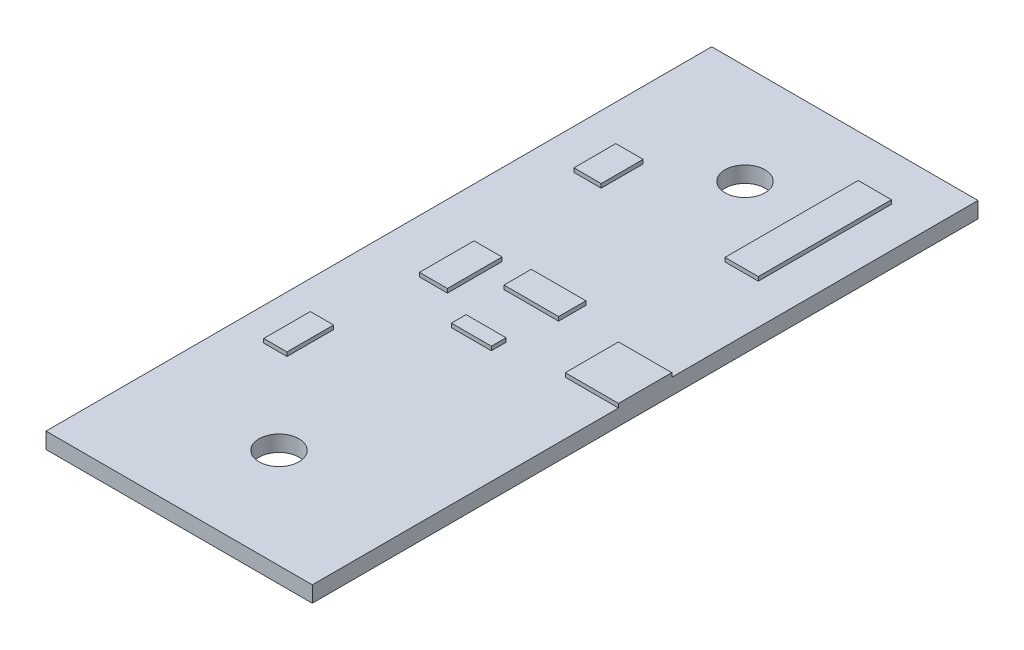
ISO-10303-21;
HEADER;
FILE_DESCRIPTION(('STEP AP214'),'2;1');
FILE_NAME('part.step','',(''),(''),'','','');
FILE_SCHEMA(('AUTOMOTIVE_DESIGN { 1 0 10303 214 1 1 1 1 }'));
ENDSEC;
DATA;
#1=APPLICATION_CONTEXT('core data for automotive mechanical design processes');
#2=APPLICATION_PROTOCOL_DEFINITION('international standard','automotive_design',2000,#1);
#3=PRODUCT_CONTEXT('',#1,'mechanical');
#4=PRODUCT('Part','Part','',(#3));
#5=PRODUCT_RELATED_PRODUCT_CATEGORY('part','',(#4));
#6=PRODUCT_DEFINITION_FORMATION('','',#4);
#7=PRODUCT_DEFINITION_CONTEXT('part definition',#1,'design');
#8=PRODUCT_DEFINITION('design','',#6,#7);
#9=PRODUCT_DEFINITION_SHAPE('','',#8);
#10=(LENGTH_UNIT() NAMED_UNIT(*) SI_UNIT(.MILLI.,.METRE.));
#11=(NAMED_UNIT(*) PLANE_ANGLE_UNIT() SI_UNIT($,.RADIAN.));
#12=(NAMED_UNIT(*) SI_UNIT($,.STERADIAN.) SOLID_ANGLE_UNIT());
#13=UNCERTAINTY_MEASURE_WITH_UNIT(LENGTH_MEASURE(1.E-05),#10,'distance_accuracy_value','');
#14=(GEOMETRIC_REPRESENTATION_CONTEXT(3) GLOBAL_UNCERTAINTY_ASSIGNED_CONTEXT((#13)) GLOBAL_UNIT_ASSIGNED_CONTEXT((#10,
#11,#12)) REPRESENTATION_CONTEXT('',''));
#15=CARTESIAN_POINT('',(0.,0.,0.));
#16=DIRECTION('',(0.,0.,1.));
#17=DIRECTION('',(1.,0.,0.));
#18=AXIS2_PLACEMENT_3D('',#15,#16,#17);
#19=CARTESIAN_POINT('',(10.,1.2,25.));
#20=DIRECTION('',(-1.,0.,0.));
#21=DIRECTION('',(0.,0.,1.));
#22=AXIS2_PLACEMENT_3D('',#19,#20,#21);
#23=PLANE('',#22);
#24=DIRECTION('',(0.,0.,-1.));
#25=VECTOR('',#24,1.);
#26=CARTESIAN_POINT('',(10.,0.,25.));
#27=LINE('',#26,#25);
#28=CARTESIAN_POINT('',(10.,0.,25.));
#29=VERTEX_POINT('',#28);
#30=CARTESIAN_POINT('',(10.,0.,-25.));
#31=VERTEX_POINT('',#30);
#32=EDGE_CURVE('E490',#29,#31,#27,.T.);
#33=ORIENTED_EDGE('',*,*,#32,.T.);
#34=DIRECTION('',(0.,-1.,0.));
#35=VECTOR('',#34,1.);
#36=CARTESIAN_POINT('',(10.,1.2,-25.));
#37=LINE('',#36,#35);
#38=CARTESIAN_POINT('',(10.,1.2,-25.));
#39=VERTEX_POINT('',#38);
#40=EDGE_CURVE('E11',#39,#31,#37,.T.);
#41=ORIENTED_EDGE('',*,*,#40,.F.);
#42=DIRECTION('',(0.,0.,-1.));
#43=VECTOR('',#42,1.);
#44=CARTESIAN_POINT('',(10.,1.2,25.));
#45=LINE('',#44,#43);
#46=CARTESIAN_POINT('',(10.,1.2,-2.));
#47=VERTEX_POINT('',#46);
#48=EDGE_CURVE('E503',#47,#39,#45,.T.);
#49=ORIENTED_EDGE('',*,*,#48,.F.);
#50=DIRECTION('',(0.,-1.,0.));
#51=VECTOR('',#50,1.);
#52=CARTESIAN_POINT('',(10.,1.5,-2.));
#53=LINE('',#52,#51);
#54=CARTESIAN_POINT('',(10.,1.5,-2.));
#55=VERTEX_POINT('',#54);
#56=EDGE_CURVE('E294',#55,#47,#53,.T.);
#57=ORIENTED_EDGE('',*,*,#56,.F.);
#58=DIRECTION('',(0.,0.,1.));
#59=VECTOR('',#58,1.);
#60=CARTESIAN_POINT('',(10.,1.5,2.));
#61=LINE('',#60,#59);
#62=CARTESIAN_POINT('',(10.,1.5,2.));
#63=VERTEX_POINT('',#62);
#64=EDGE_CURVE('E282',#55,#63,#61,.T.);
#65=ORIENTED_EDGE('',*,*,#64,.T.);
#66=DIRECTION('',(0.,-1.,0.));
#67=VECTOR('',#66,1.);
#68=CARTESIAN_POINT('',(10.,1.5,2.));
#69=LINE('',#68,#67);
#70=CARTESIAN_POINT('',(10.,1.2,2.));
#71=VERTEX_POINT('',#70);
#72=EDGE_CURVE('E293',#63,#71,#69,.T.);
#73=ORIENTED_EDGE('',*,*,#72,.T.);
#74=CARTESIAN_POINT('',(10.,1.2,25.));
#75=VERTEX_POINT('',#74);
#76=EDGE_CURVE('E499',#75,#71,#45,.T.);
#77=ORIENTED_EDGE('',*,*,#76,.F.);
#78=DIRECTION('',(0.,-1.,0.));
#79=VECTOR('',#78,1.);
#80=CARTESIAN_POINT('',(10.,1.2,25.));
#81=LINE('',#80,#79);
#82=EDGE_CURVE('E509',#75,#29,#81,.T.);
#83=ORIENTED_EDGE('',*,*,#82,.T.);
#84=EDGE_LOOP('',(#33,#41,#49,#57,#65,#73,#77,#83));
#85=FACE_BOUND('',#84,.T.);
#86=ADVANCED_FACE('F34',(#85),#23,.F.);
#87=CARTESIAN_POINT('',(-9.99999999999999,1.2,-25.));
#88=DIRECTION('',(0.,0.,1.));
#89=DIRECTION('',(1.,0.,0.));
#90=AXIS2_PLACEMENT_3D('',#87,#88,#89);
#91=PLANE('',#90);
#92=DIRECTION('',(-1.,0.,0.));
#93=VECTOR('',#92,1.);
#94=CARTESIAN_POINT('',(-9.99999999999999,0.,-25.));
#95=LINE('',#94,#93);
#96=CARTESIAN_POINT('',(-9.99999999999999,0.,-25.));
#97=VERTEX_POINT('',#96);
#98=EDGE_CURVE('E511',#31,#97,#95,.T.);
#99=ORIENTED_EDGE('',*,*,#98,.T.);
#100=DIRECTION('',(0.,-1.,0.));
#101=VECTOR('',#100,1.);
#102=CARTESIAN_POINT('',(-9.99999999999999,1.2,-25.));
#103=LINE('',#102,#101);
#104=CARTESIAN_POINT('',(-9.99999999999999,1.2,-25.));
#105=VERTEX_POINT('',#104);
#106=EDGE_CURVE('E41',#105,#97,#103,.T.);
#107=ORIENTED_EDGE('',*,*,#106,.F.);
#108=DIRECTION('',(-1.,0.,0.));
#109=VECTOR('',#108,1.);
#110=CARTESIAN_POINT('',(-9.99999999999999,1.2,-25.));
#111=LINE('',#110,#109);
#112=EDGE_CURVE('E502',#39,#105,#111,.T.);
#113=ORIENTED_EDGE('',*,*,#112,.F.);
#114=ORIENTED_EDGE('',*,*,#40,.T.);
#115=EDGE_LOOP('',(#99,#107,#113,#114));
#116=FACE_BOUND('',#115,.T.);
#117=ADVANCED_FACE('F546',(#116),#91,.F.);
#118=CARTESIAN_POINT('',(-9.99999999999999,1.2,25.));
#119=DIRECTION('',(1.,0.,0.));
#120=DIRECTION('',(0.,0.,-1.));
#121=AXIS2_PLACEMENT_3D('',#118,#119,#120);
#122=PLANE('',#121);
#123=DIRECTION('',(0.,0.,1.));
#124=VECTOR('',#123,1.);
#125=CARTESIAN_POINT('',(-9.99999999999999,0.,25.));
#126=LINE('',#125,#124);
#127=CARTESIAN_POINT('',(-9.99999999999999,0.,25.));
#128=VERTEX_POINT('',#127);
#129=EDGE_CURVE('E513',#97,#128,#126,.T.);
#130=ORIENTED_EDGE('',*,*,#129,.T.);
#131=DIRECTION('',(0.,-1.,0.));
#132=VECTOR('',#131,1.);
#133=CARTESIAN_POINT('',(-9.99999999999999,1.2,25.));
#134=LINE('',#133,#132);
#135=CARTESIAN_POINT('',(-9.99999999999999,1.2,25.));
#136=VERTEX_POINT('',#135);
#137=EDGE_CURVE('E519',#136,#128,#134,.T.);
#138=ORIENTED_EDGE('',*,*,#137,.F.);
#139=DIRECTION('',(0.,0.,1.));
#140=VECTOR('',#139,1.);
#141=CARTESIAN_POINT('',(-9.99999999999999,1.2,25.));
#142=LINE('',#141,#140);
#143=EDGE_CURVE('E505',#105,#136,#142,.T.);
#144=ORIENTED_EDGE('',*,*,#143,.F.);
#145=ORIENTED_EDGE('',*,*,#106,.T.);
#146=EDGE_LOOP('',(#130,#138,#144,#145));
#147=FACE_BOUND('',#146,.T.);
#148=ADVANCED_FACE('F526',(#147),#122,.F.);
#149=CARTESIAN_POINT('',(-9.99999999999999,1.2,25.));
#150=DIRECTION('',(0.,0.,-1.));
#151=DIRECTION('',(-1.,0.,0.));
#152=AXIS2_PLACEMENT_3D('',#149,#150,#151);
#153=PLANE('',#152);
#154=DIRECTION('',(1.,0.,0.));
#155=VECTOR('',#154,1.);
#156=CARTESIAN_POINT('',(-9.99999999999999,0.,25.));
#157=LINE('',#156,#155);
#158=EDGE_CURVE('E515',#128,#29,#157,.T.);
#159=ORIENTED_EDGE('',*,*,#158,.T.);
#160=ORIENTED_EDGE('',*,*,#82,.F.);
#161=DIRECTION('',(1.,0.,0.));
#162=VECTOR('',#161,1.);
#163=CARTESIAN_POINT('',(-9.99999999999999,1.2,25.));
#164=LINE('',#163,#162);
#165=EDGE_CURVE('E507',#136,#75,#164,.T.);
#166=ORIENTED_EDGE('',*,*,#165,.F.);
#167=ORIENTED_EDGE('',*,*,#137,.T.);
#168=EDGE_LOOP('',(#159,#160,#166,#167));
#169=FACE_BOUND('',#168,.T.);
#170=ADVANCED_FACE('F538',(#169),#153,.F.);
#171=CARTESIAN_POINT('',(0.,1.2,0.));
#172=DIRECTION('',(0.,-1.,0.));
#173=DIRECTION('',(0.,0.,-1.));
#174=AXIS2_PLACEMENT_3D('',#171,#172,#173);
#175=PLANE('',#174);
#176=DIRECTION('',(-1.,0.,0.));
#177=VECTOR('',#176,1.);
#178=CARTESIAN_POINT('',(0.,1.2,11.1));
#179=LINE('',#178,#177);
#180=CARTESIAN_POINT('',(-5.79999999999999,1.2,11.1));
#181=VERTEX_POINT('',#180);
#182=CARTESIAN_POINT('',(-7.54999999999999,1.2,11.1));
#183=VERTEX_POINT('',#182);
#184=EDGE_CURVE('E277',#181,#183,#179,.T.);
#185=ORIENTED_EDGE('',*,*,#184,.T.);
#186=DIRECTION('',(0.,0.,-1.));
#187=VECTOR('',#186,1.);
#188=CARTESIAN_POINT('',(-7.54999999999999,1.2,0.));
#189=LINE('',#188,#187);
#190=CARTESIAN_POINT('',(-7.54999999999999,1.2,7.59999999999999));
#191=VERTEX_POINT('',#190);
#192=EDGE_CURVE('E280',#183,#191,#189,.T.);
#193=ORIENTED_EDGE('',*,*,#192,.T.);
#194=DIRECTION('',(1.,0.,0.));
#195=VECTOR('',#194,1.);
#196=CARTESIAN_POINT('',(0.,1.2,7.59999999999999));
#197=LINE('',#196,#195);
#198=CARTESIAN_POINT('',(-5.79999999999999,1.2,7.59999999999999));
#199=VERTEX_POINT('',#198);
#200=EDGE_CURVE('E245',#191,#199,#197,.T.);
#201=ORIENTED_EDGE('',*,*,#200,.T.);
#202=DIRECTION('',(0.,0.,1.));
#203=VECTOR('',#202,1.);
#204=CARTESIAN_POINT('',(-5.79999999999999,1.2,0.));
#205=LINE('',#204,#203);
#206=EDGE_CURVE('E274',#199,#181,#205,.T.);
#207=ORIENTED_EDGE('',*,*,#206,.T.);
#208=EDGE_LOOP('',(#185,#193,#201,#207));
#209=FACE_BOUND('',#208,.T.);
#210=DIRECTION('',(-1.,0.,0.));
#211=VECTOR('',#210,1.);
#212=CARTESIAN_POINT('',(0.,1.2,3.04999999999999));
#213=LINE('',#212,#211);
#214=CARTESIAN_POINT('',(1.50000000000001,1.2,3.04999999999999));
#215=VERTEX_POINT('',#214);
#216=CARTESIAN_POINT('',(-1.49999999999999,1.2,3.04999999999999));
#217=VERTEX_POINT('',#216);
#218=EDGE_CURVE('E340',#215,#217,#213,.T.);
#219=ORIENTED_EDGE('',*,*,#218,.T.);
#220=DIRECTION('',(0.,0.,-1.));
#221=VECTOR('',#220,1.);
#222=CARTESIAN_POINT('',(-1.49999999999999,1.2,0.));
#223=LINE('',#222,#221);
#224=CARTESIAN_POINT('',(-1.49999999999999,1.2,1.94999999999999));
#225=VERTEX_POINT('',#224);
#226=EDGE_CURVE('E343',#217,#225,#223,.T.);
#227=ORIENTED_EDGE('',*,*,#226,.T.);
#228=DIRECTION('',(1.,0.,0.));
#229=VECTOR('',#228,1.);
#230=CARTESIAN_POINT('',(0.,1.2,1.94999999999999));
#231=LINE('',#230,#229);
#232=CARTESIAN_POINT('',(1.50000000000001,1.2,1.94999999999999));
#233=VERTEX_POINT('',#232);
#234=EDGE_CURVE('E327',#225,#233,#231,.T.);
#235=ORIENTED_EDGE('',*,*,#234,.T.);
#236=DIRECTION('',(0.,0.,1.));
#237=VECTOR('',#236,1.);
#238=CARTESIAN_POINT('',(1.50000000000001,1.2,0.));
#239=LINE('',#238,#237);
#240=EDGE_CURVE('E337',#233,#215,#239,.T.);
#241=ORIENTED_EDGE('',*,*,#240,.T.);
#242=EDGE_LOOP('',(#219,#227,#235,#241));
#243=FACE_BOUND('',#242,.T.);
#244=DIRECTION('',(-1.,0.,0.));
#245=VECTOR('',#244,1.);
#246=CARTESIAN_POINT('',(0.,1.2,-1.40000000000002));
#247=LINE('',#246,#245);
#248=CARTESIAN_POINT('',(2.1,1.2,-1.40000000000002));
#249=VERTEX_POINT('',#248);
#250=CARTESIAN_POINT('',(-1.99999999999999,1.2,-1.40000000000002));
#251=VERTEX_POINT('',#250);
#252=EDGE_CURVE('E375',#249,#251,#247,.T.);
#253=ORIENTED_EDGE('',*,*,#252,.T.);
#254=DIRECTION('',(0.,0.,-1.));
#255=VECTOR('',#254,1.);
#256=CARTESIAN_POINT('',(-2.,1.2,0.));
#257=LINE('',#256,#255);
#258=CARTESIAN_POINT('',(-1.99999999999999,1.2,-3.45000000000002));
#259=VERTEX_POINT('',#258);
#260=EDGE_CURVE('E378',#251,#259,#257,.T.);
#261=ORIENTED_EDGE('',*,*,#260,.T.);
#262=DIRECTION('',(1.,0.,0.));
#263=VECTOR('',#262,1.);
#264=CARTESIAN_POINT('',(0.,1.2,-3.45000000000002));
#265=LINE('',#264,#263);
#266=CARTESIAN_POINT('',(2.1,1.2,-3.45000000000002));
#267=VERTEX_POINT('',#266);
#268=EDGE_CURVE('E362',#259,#267,#265,.T.);
#269=ORIENTED_EDGE('',*,*,#268,.T.);
#270=DIRECTION('',(0.,0.,1.));
#271=VECTOR('',#270,1.);
#272=CARTESIAN_POINT('',(2.1,1.2,0.));
#273=LINE('',#272,#271);
#274=EDGE_CURVE('E372',#267,#249,#273,.T.);
#275=ORIENTED_EDGE('',*,*,#274,.T.);
#276=EDGE_LOOP('',(#253,#261,#269,#275));
#277=FACE_BOUND('',#276,.T.);
#278=DIRECTION('',(-1.,0.,0.));
#279=VECTOR('',#278,1.);
#280=CARTESIAN_POINT('',(0.,1.2,0.949999999999986));
#281=LINE('',#280,#279);
#282=CARTESIAN_POINT('',(-3.89999999999999,1.2,0.949999999999986));
#283=VERTEX_POINT('',#282);
#284=CARTESIAN_POINT('',(-5.99999999999999,1.2,0.949999999999986));
#285=VERTEX_POINT('',#284);
#286=EDGE_CURVE('E410',#283,#285,#281,.T.);
#287=ORIENTED_EDGE('',*,*,#286,.T.);
#288=DIRECTION('',(0.,0.,-1.));
#289=VECTOR('',#288,1.);
#290=CARTESIAN_POINT('',(-5.99999999999999,1.2,0.));
#291=LINE('',#290,#289);
#292=CARTESIAN_POINT('',(-5.99999999999999,1.2,-3.15000000000001));
#293=VERTEX_POINT('',#292);
#294=EDGE_CURVE('E413',#285,#293,#291,.T.);
#295=ORIENTED_EDGE('',*,*,#294,.T.);
#296=DIRECTION('',(1.,0.,0.));
#297=VECTOR('',#296,1.);
#298=CARTESIAN_POINT('',(0.,1.2,-3.15000000000001));
#299=LINE('',#298,#297);
#300=CARTESIAN_POINT('',(-3.89999999999999,1.2,-3.15000000000001));
#301=VERTEX_POINT('',#300);
#302=EDGE_CURVE('E397',#293,#301,#299,.T.);
#303=ORIENTED_EDGE('',*,*,#302,.T.);
#304=DIRECTION('',(0.,0.,1.));
#305=VECTOR('',#304,1.);
#306=CARTESIAN_POINT('',(-3.89999999999999,1.2,0.));
#307=LINE('',#306,#305);
#308=EDGE_CURVE('E407',#301,#283,#307,.T.);
#309=ORIENTED_EDGE('',*,*,#308,.T.);
#310=EDGE_LOOP('',(#287,#295,#303,#309));
#311=FACE_BOUND('',#310,.T.);
#312=DIRECTION('',(-1.,0.,0.));
#313=VECTOR('',#312,1.);
#314=CARTESIAN_POINT('',(0.,1.2,-11.65));
#315=LINE('',#314,#313);
#316=CARTESIAN_POINT('',(-4.94999999999999,1.2,-11.65));
#317=VERTEX_POINT('',#316);
#318=CARTESIAN_POINT('',(-7.,1.2,-11.65));
#319=VERTEX_POINT('',#318);
#320=EDGE_CURVE('E445',#317,#319,#315,.T.);
#321=ORIENTED_EDGE('',*,*,#320,.T.);
#322=DIRECTION('',(0.,0.,-1.));
#323=VECTOR('',#322,1.);
#324=CARTESIAN_POINT('',(-7.,1.2,0.));
#325=LINE('',#324,#323);
#326=CARTESIAN_POINT('',(-6.99999999999999,1.2,-14.8));
#327=VERTEX_POINT('',#326);
#328=EDGE_CURVE('E448',#319,#327,#325,.T.);
#329=ORIENTED_EDGE('',*,*,#328,.T.);
#330=DIRECTION('',(1.,0.,0.));
#331=VECTOR('',#330,1.);
#332=CARTESIAN_POINT('',(0.,1.2,-14.8));
#333=LINE('',#332,#331);
#334=CARTESIAN_POINT('',(-4.94999999999999,1.2,-14.8));
#335=VERTEX_POINT('',#334);
#336=EDGE_CURVE('E432',#327,#335,#333,.T.);
#337=ORIENTED_EDGE('',*,*,#336,.T.);
#338=DIRECTION('',(0.,0.,1.));
#339=VECTOR('',#338,1.);
#340=CARTESIAN_POINT('',(-4.94999999999999,1.2,0.));
#341=LINE('',#340,#339);
#342=EDGE_CURVE('E442',#335,#317,#341,.T.);
#343=ORIENTED_EDGE('',*,*,#342,.T.);
#344=EDGE_LOOP('',(#321,#329,#337,#343));
#345=FACE_BOUND('',#344,.T.);
#346=DIRECTION('',(-1.,0.,0.));
#347=VECTOR('',#346,1.);
#348=CARTESIAN_POINT('',(0.,1.2,-11.5));
#349=LINE('',#348,#347);
#350=CARTESIAN_POINT('',(7.00000000000001,1.2,-11.5));
#351=VERTEX_POINT('',#350);
#352=CARTESIAN_POINT('',(4.50000000000001,1.2,-11.5));
#353=VERTEX_POINT('',#352);
#354=EDGE_CURVE('E480',#351,#353,#349,.T.);
#355=ORIENTED_EDGE('',*,*,#354,.T.);
#356=DIRECTION('',(0.,0.,-1.));
#357=VECTOR('',#356,1.);
#358=CARTESIAN_POINT('',(4.50000000000001,1.2,0.));
#359=LINE('',#358,#357);
#360=CARTESIAN_POINT('',(4.50000000000001,1.2,-21.5));
#361=VERTEX_POINT('',#360);
#362=EDGE_CURVE('E483',#353,#361,#359,.T.);
#363=ORIENTED_EDGE('',*,*,#362,.T.);
#364=DIRECTION('',(1.,0.,0.));
#365=VECTOR('',#364,1.);
#366=CARTESIAN_POINT('',(0.,1.2,-21.5));
#367=LINE('',#366,#365);
#368=CARTESIAN_POINT('',(7.00000000000001,1.2,-21.5));
#369=VERTEX_POINT('',#368);
#370=EDGE_CURVE('E467',#361,#369,#367,.T.);
#371=ORIENTED_EDGE('',*,*,#370,.T.);
#372=DIRECTION('',(0.,0.,1.));
#373=VECTOR('',#372,1.);
#374=CARTESIAN_POINT('',(7.00000000000001,1.2,0.));
#375=LINE('',#374,#373);
#376=EDGE_CURVE('E477',#369,#351,#375,.T.);
#377=ORIENTED_EDGE('',*,*,#376,.T.);
#378=EDGE_LOOP('',(#355,#363,#371,#377));
#379=FACE_BOUND('',#378,.T.);
#380=CARTESIAN_POINT('',(0.,1.2,17.5));
#381=DIRECTION('',(0.,-1.,0.));
#382=DIRECTION('',(0.,0.,-1.));
#383=AXIS2_PLACEMENT_3D('',#380,#381,#382);
#384=CIRCLE('',#383,1.5);
#385=CARTESIAN_POINT('',(0.,1.2,16.));
#386=VERTEX_POINT('',#385);
#387=EDGE_CURVE('E487',#386,#386,#384,.T.);
#388=ORIENTED_EDGE('',*,*,#387,.T.);
#389=EDGE_LOOP('',(#388));
#390=FACE_BOUND('',#389,.T.);
#391=CARTESIAN_POINT('',(0.,1.2,-17.5));
#392=DIRECTION('',(0.,-1.,0.));
#393=DIRECTION('',(0.,0.,1.));
#394=AXIS2_PLACEMENT_3D('',#391,#392,#393);
#395=CIRCLE('',#394,1.5);
#396=CARTESIAN_POINT('',(0.,1.2,-16.));
#397=VERTEX_POINT('',#396);
#398=EDGE_CURVE('E494',#397,#397,#395,.T.);
#399=ORIENTED_EDGE('',*,*,#398,.T.);
#400=EDGE_LOOP('',(#399));
#401=FACE_BOUND('',#400,.T.);
#402=DIRECTION('',(0.,0.,-1.));
#403=VECTOR('',#402,1.);
#404=CARTESIAN_POINT('',(6.00000000000001,1.2,0.));
#405=LINE('',#404,#403);
#406=CARTESIAN_POINT('',(6.00000000000001,1.2,2.));
#407=VERTEX_POINT('',#406);
#408=CARTESIAN_POINT('',(6.00000000000001,1.2,-2.));
#409=VERTEX_POINT('',#408);
#410=EDGE_CURVE('E305',#407,#409,#405,.T.);
#411=ORIENTED_EDGE('',*,*,#410,.T.);
#412=DIRECTION('',(1.,0.,0.));
#413=VECTOR('',#412,1.);
#414=CARTESIAN_POINT('',(0.,1.2,-2.));
#415=LINE('',#414,#413);
#416=EDGE_CURVE('E308',#409,#47,#415,.T.);
#417=ORIENTED_EDGE('',*,*,#416,.T.);
#418=ORIENTED_EDGE('',*,*,#48,.T.);
#419=ORIENTED_EDGE('',*,*,#112,.T.);
#420=ORIENTED_EDGE('',*,*,#143,.T.);
#421=ORIENTED_EDGE('',*,*,#165,.T.);
#422=ORIENTED_EDGE('',*,*,#76,.T.);
#423=DIRECTION('',(-1.,0.,0.));
#424=VECTOR('',#423,1.);
#425=CARTESIAN_POINT('',(0.,1.2,2.00000000000001));
#426=LINE('',#425,#424);
#427=EDGE_CURVE('E296',#71,#407,#426,.T.);
#428=ORIENTED_EDGE('',*,*,#427,.T.);
#429=EDGE_LOOP('',(#411,#417,#418,#419,#420,#421,#422,#428));
#430=FACE_BOUND('',#429,.T.);
#431=ADVANCED_FACE('F544',(#209,#243,#277,#311,#345,#379,#390,#401,#430),#175,.F.);
#432=CARTESIAN_POINT('',(0.,0.,0.));
#433=DIRECTION('',(0.,-1.,0.));
#434=DIRECTION('',(0.,0.,-1.));
#435=AXIS2_PLACEMENT_3D('',#432,#433,#434);
#436=PLANE('',#435);
#437=ORIENTED_EDGE('',*,*,#98,.F.);
#438=ORIENTED_EDGE('',*,*,#32,.F.);
#439=ORIENTED_EDGE('',*,*,#158,.F.);
#440=ORIENTED_EDGE('',*,*,#129,.F.);
#441=EDGE_LOOP('',(#437,#438,#439,#440));
#442=FACE_BOUND('',#441,.T.);
#443=CARTESIAN_POINT('',(0.,0.,17.5));
#444=DIRECTION('',(0.,-1.,0.));
#445=DIRECTION('',(0.,0.,-1.));
#446=AXIS2_PLACEMENT_3D('',#443,#444,#445);
#447=CIRCLE('',#446,1.5);
#448=CARTESIAN_POINT('',(0.,0.,16.));
#449=VERTEX_POINT('',#448);
#450=EDGE_CURVE('E491',#449,#449,#447,.T.);
#451=ORIENTED_EDGE('',*,*,#450,.F.);
#452=EDGE_LOOP('',(#451));
#453=FACE_BOUND('',#452,.T.);
#454=CARTESIAN_POINT('',(0.,0.,-17.5));
#455=DIRECTION('',(0.,-1.,0.));
#456=DIRECTION('',(0.,0.,1.));
#457=AXIS2_PLACEMENT_3D('',#454,#455,#456);
#458=CIRCLE('',#457,1.5);
#459=CARTESIAN_POINT('',(0.,0.,-16.));
#460=VERTEX_POINT('',#459);
#461=EDGE_CURVE('E486',#460,#460,#458,.T.);
#462=ORIENTED_EDGE('',*,*,#461,.F.);
#463=EDGE_LOOP('',(#462));
#464=FACE_BOUND('',#463,.T.);
#465=ADVANCED_FACE('F533',(#442,#453,#464),#436,.T.);
#466=CARTESIAN_POINT('',(0.,1.2,-17.5));
#467=DIRECTION('',(0.,-1.,0.));
#468=DIRECTION('',(0.,0.,-1.));
#469=AXIS2_PLACEMENT_3D('',#466,#467,#468);
#470=CYLINDRICAL_SURFACE('',#469,1.5);
#471=ORIENTED_EDGE('',*,*,#398,.F.);
#472=EDGE_LOOP('',(#471));
#473=FACE_BOUND('',#472,.T.);
#474=ORIENTED_EDGE('',*,*,#461,.T.);
#475=EDGE_LOOP('',(#474));
#476=FACE_BOUND('',#475,.T.);
#477=ADVANCED_FACE('F580',(#473,#476),#470,.F.);
#478=CARTESIAN_POINT('',(0.,1.2,17.5));
#479=DIRECTION('',(0.,-1.,0.));
#480=DIRECTION('',(0.,0.,-1.));
#481=AXIS2_PLACEMENT_3D('',#478,#479,#480);
#482=CYLINDRICAL_SURFACE('',#481,1.5);
#483=ORIENTED_EDGE('',*,*,#387,.F.);
#484=EDGE_LOOP('',(#483));
#485=FACE_BOUND('',#484,.T.);
#486=ORIENTED_EDGE('',*,*,#450,.T.);
#487=EDGE_LOOP('',(#486));
#488=FACE_BOUND('',#487,.T.);
#489=ADVANCED_FACE('F586',(#485,#488),#482,.F.);
#490=CARTESIAN_POINT('',(4.50000000000001,1.5,-21.5));
#491=DIRECTION('',(-1.,0.,0.));
#492=DIRECTION('',(0.,0.,1.));
#493=AXIS2_PLACEMENT_3D('',#490,#491,#492);
#494=PLANE('',#493);
#495=ORIENTED_EDGE('',*,*,#362,.F.);
#496=DIRECTION('',(0.,-1.,0.));
#497=VECTOR('',#496,1.);
#498=CARTESIAN_POINT('',(4.50000000000001,1.5,-11.5));
#499=LINE('',#498,#497);
#500=CARTESIAN_POINT('',(4.50000000000001,1.5,-11.5));
#501=VERTEX_POINT('',#500);
#502=EDGE_CURVE('E464',#501,#353,#499,.T.);
#503=ORIENTED_EDGE('',*,*,#502,.F.);
#504=DIRECTION('',(0.,0.,-1.));
#505=VECTOR('',#504,1.);
#506=CARTESIAN_POINT('',(4.50000000000001,1.5,-21.5));
#507=LINE('',#506,#505);
#508=CARTESIAN_POINT('',(4.50000000000001,1.5,-21.5));
#509=VERTEX_POINT('',#508);
#510=EDGE_CURVE('E451',#501,#509,#507,.T.);
#511=ORIENTED_EDGE('',*,*,#510,.T.);
#512=DIRECTION('',(0.,-1.,0.));
#513=VECTOR('',#512,1.);
#514=CARTESIAN_POINT('',(4.50000000000001,1.5,-21.5));
#515=LINE('',#514,#513);
#516=EDGE_CURVE('E463',#509,#361,#515,.T.);
#517=ORIENTED_EDGE('',*,*,#516,.T.);
#518=EDGE_LOOP('',(#495,#503,#511,#517));
#519=FACE_BOUND('',#518,.T.);
#520=ADVANCED_FACE('F590',(#519),#494,.T.);
#521=CARTESIAN_POINT('',(4.50000000000001,1.5,-11.5));
#522=DIRECTION('',(0.,0.,1.));
#523=DIRECTION('',(1.,0.,0.));
#524=AXIS2_PLACEMENT_3D('',#521,#522,#523);
#525=PLANE('',#524);
#526=ORIENTED_EDGE('',*,*,#354,.F.);
#527=DIRECTION('',(0.,-1.,0.));
#528=VECTOR('',#527,1.);
#529=CARTESIAN_POINT('',(7.00000000000001,1.5,-11.5));
#530=LINE('',#529,#528);
#531=CARTESIAN_POINT('',(7.00000000000001,1.5,-11.5));
#532=VERTEX_POINT('',#531);
#533=EDGE_CURVE('E468',#532,#351,#530,.T.);
#534=ORIENTED_EDGE('',*,*,#533,.F.);
#535=DIRECTION('',(-1.,0.,0.));
#536=VECTOR('',#535,1.);
#537=CARTESIAN_POINT('',(4.50000000000001,1.5,-11.5));
#538=LINE('',#537,#536);
#539=EDGE_CURVE('E460',#532,#501,#538,.T.);
#540=ORIENTED_EDGE('',*,*,#539,.T.);
#541=ORIENTED_EDGE('',*,*,#502,.T.);
#542=EDGE_LOOP('',(#526,#534,#540,#541));
#543=FACE_BOUND('',#542,.T.);
#544=ADVANCED_FACE('F594',(#543),#525,.T.);
#545=CARTESIAN_POINT('',(7.00000000000001,1.5,-21.5));
#546=DIRECTION('',(1.,0.,0.));
#547=DIRECTION('',(0.,0.,-1.));
#548=AXIS2_PLACEMENT_3D('',#545,#546,#547);
#549=PLANE('',#548);
#550=ORIENTED_EDGE('',*,*,#376,.F.);
#551=DIRECTION('',(0.,-1.,0.));
#552=VECTOR('',#551,1.);
#553=CARTESIAN_POINT('',(7.00000000000001,1.5,-21.5));
#554=LINE('',#553,#552);
#555=CARTESIAN_POINT('',(7.00000000000001,1.5,-21.5));
#556=VERTEX_POINT('',#555);
#557=EDGE_CURVE('E471',#556,#369,#554,.T.);
#558=ORIENTED_EDGE('',*,*,#557,.F.);
#559=DIRECTION('',(0.,0.,1.));
#560=VECTOR('',#559,1.);
#561=CARTESIAN_POINT('',(7.00000000000001,1.5,-21.5));
#562=LINE('',#561,#560);
#563=EDGE_CURVE('E457',#556,#532,#562,.T.);
#564=ORIENTED_EDGE('',*,*,#563,.T.);
#565=ORIENTED_EDGE('',*,*,#533,.T.);
#566=EDGE_LOOP('',(#550,#558,#564,#565));
#567=FACE_BOUND('',#566,.T.);
#568=ADVANCED_FACE('F600',(#567),#549,.T.);
#569=CARTESIAN_POINT('',(4.50000000000001,1.5,-21.5));
#570=DIRECTION('',(0.,0.,-1.));
#571=DIRECTION('',(-1.,0.,0.));
#572=AXIS2_PLACEMENT_3D('',#569,#570,#571);
#573=PLANE('',#572);
#574=ORIENTED_EDGE('',*,*,#370,.F.);
#575=ORIENTED_EDGE('',*,*,#516,.F.);
#576=DIRECTION('',(1.,0.,0.));
#577=VECTOR('',#576,1.);
#578=CARTESIAN_POINT('',(4.50000000000001,1.5,-21.5));
#579=LINE('',#578,#577);
#580=EDGE_CURVE('E454',#509,#556,#579,.T.);
#581=ORIENTED_EDGE('',*,*,#580,.T.);
#582=ORIENTED_EDGE('',*,*,#557,.T.);
#583=EDGE_LOOP('',(#574,#575,#581,#582));
#584=FACE_BOUND('',#583,.T.);
#585=ADVANCED_FACE('F596',(#584),#573,.T.);
#586=CARTESIAN_POINT('',(0.,1.5,0.));
#587=DIRECTION('',(0.,1.,0.));
#588=DIRECTION('',(0.,0.,1.));
#589=AXIS2_PLACEMENT_3D('',#586,#587,#588);
#590=PLANE('',#589);
#591=ORIENTED_EDGE('',*,*,#510,.F.);
#592=ORIENTED_EDGE('',*,*,#539,.F.);
#593=ORIENTED_EDGE('',*,*,#563,.F.);
#594=ORIENTED_EDGE('',*,*,#580,.F.);
#595=EDGE_LOOP('',(#591,#592,#593,#594));
#596=FACE_BOUND('',#595,.T.);
#597=ADVANCED_FACE('F599',(#596),#590,.T.);
#598=CARTESIAN_POINT('',(-6.99999999999999,1.5,-14.8));
#599=DIRECTION('',(-1.,0.,0.));
#600=DIRECTION('',(0.,0.,1.));
#601=AXIS2_PLACEMENT_3D('',#598,#599,#600);
#602=PLANE('',#601);
#603=ORIENTED_EDGE('',*,*,#328,.F.);
#604=DIRECTION('',(0.,-1.,0.));
#605=VECTOR('',#604,1.);
#606=CARTESIAN_POINT('',(-7.,1.5,-11.65));
#607=LINE('',#606,#605);
#608=CARTESIAN_POINT('',(-7.,1.5,-11.65));
#609=VERTEX_POINT('',#608);
#610=EDGE_CURVE('E429',#609,#319,#607,.T.);
#611=ORIENTED_EDGE('',*,*,#610,.F.);
#612=DIRECTION('',(0.,0.,-1.));
#613=VECTOR('',#612,1.);
#614=CARTESIAN_POINT('',(-6.99999999999999,1.5,-14.8));
#615=LINE('',#614,#613);
#616=CARTESIAN_POINT('',(-6.99999999999999,1.5,-14.8));
#617=VERTEX_POINT('',#616);
#618=EDGE_CURVE('E416',#609,#617,#615,.T.);
#619=ORIENTED_EDGE('',*,*,#618,.T.);
#620=DIRECTION('',(0.,-1.,0.));
#621=VECTOR('',#620,1.);
#622=CARTESIAN_POINT('',(-6.99999999999999,1.5,-14.8));
#623=LINE('',#622,#621);
#624=EDGE_CURVE('E428',#617,#327,#623,.T.);
#625=ORIENTED_EDGE('',*,*,#624,.T.);
#626=EDGE_LOOP('',(#603,#611,#619,#625));
#627=FACE_BOUND('',#626,.T.);
#628=ADVANCED_FACE('F610',(#627),#602,.T.);
#629=CARTESIAN_POINT('',(-7.,1.5,-11.65));
#630=DIRECTION('',(0.,0.,1.));
#631=DIRECTION('',(1.,0.,0.));
#632=AXIS2_PLACEMENT_3D('',#629,#630,#631);
#633=PLANE('',#632);
#634=ORIENTED_EDGE('',*,*,#320,.F.);
#635=DIRECTION('',(0.,-1.,0.));
#636=VECTOR('',#635,1.);
#637=CARTESIAN_POINT('',(-4.94999999999999,1.5,-11.65));
#638=LINE('',#637,#636);
#639=CARTESIAN_POINT('',(-4.94999999999999,1.5,-11.65));
#640=VERTEX_POINT('',#639);
#641=EDGE_CURVE('E433',#640,#317,#638,.T.);
#642=ORIENTED_EDGE('',*,*,#641,.F.);
#643=DIRECTION('',(-1.,0.,0.));
#644=VECTOR('',#643,1.);
#645=CARTESIAN_POINT('',(-7.,1.5,-11.65));
#646=LINE('',#645,#644);
#647=EDGE_CURVE('E425',#640,#609,#646,.T.);
#648=ORIENTED_EDGE('',*,*,#647,.T.);
#649=ORIENTED_EDGE('',*,*,#610,.T.);
#650=EDGE_LOOP('',(#634,#642,#648,#649));
#651=FACE_BOUND('',#650,.T.);
#652=ADVANCED_FACE('F614',(#651),#633,.T.);
#653=CARTESIAN_POINT('',(-4.94999999999999,1.5,-14.8));
#654=DIRECTION('',(1.,0.,0.));
#655=DIRECTION('',(0.,0.,-1.));
#656=AXIS2_PLACEMENT_3D('',#653,#654,#655);
#657=PLANE('',#656);
#658=ORIENTED_EDGE('',*,*,#342,.F.);
#659=DIRECTION('',(0.,-1.,0.));
#660=VECTOR('',#659,1.);
#661=CARTESIAN_POINT('',(-4.94999999999999,1.5,-14.8));
#662=LINE('',#661,#660);
#663=CARTESIAN_POINT('',(-4.94999999999999,1.5,-14.8));
#664=VERTEX_POINT('',#663);
#665=EDGE_CURVE('E436',#664,#335,#662,.T.);
#666=ORIENTED_EDGE('',*,*,#665,.F.);
#667=DIRECTION('',(0.,0.,1.));
#668=VECTOR('',#667,1.);
#669=CARTESIAN_POINT('',(-4.94999999999999,1.5,-14.8));
#670=LINE('',#669,#668);
#671=EDGE_CURVE('E422',#664,#640,#670,.T.);
#672=ORIENTED_EDGE('',*,*,#671,.T.);
#673=ORIENTED_EDGE('',*,*,#641,.T.);
#674=EDGE_LOOP('',(#658,#666,#672,#673));
#675=FACE_BOUND('',#674,.T.);
#676=ADVANCED_FACE('F620',(#675),#657,.T.);
#677=CARTESIAN_POINT('',(-6.99999999999999,1.5,-14.8));
#678=DIRECTION('',(0.,0.,-1.));
#679=DIRECTION('',(-1.,0.,0.));
#680=AXIS2_PLACEMENT_3D('',#677,#678,#679);
#681=PLANE('',#680);
#682=ORIENTED_EDGE('',*,*,#336,.F.);
#683=ORIENTED_EDGE('',*,*,#624,.F.);
#684=DIRECTION('',(1.,0.,0.));
#685=VECTOR('',#684,1.);
#686=CARTESIAN_POINT('',(-6.99999999999999,1.5,-14.8));
#687=LINE('',#686,#685);
#688=EDGE_CURVE('E419',#617,#664,#687,.T.);
#689=ORIENTED_EDGE('',*,*,#688,.T.);
#690=ORIENTED_EDGE('',*,*,#665,.T.);
#691=EDGE_LOOP('',(#682,#683,#689,#690));
#692=FACE_BOUND('',#691,.T.);
#693=ADVANCED_FACE('F616',(#692),#681,.T.);
#694=CARTESIAN_POINT('',(0.,1.5,0.));
#695=DIRECTION('',(0.,1.,0.));
#696=DIRECTION('',(0.,0.,1.));
#697=AXIS2_PLACEMENT_3D('',#694,#695,#696);
#698=PLANE('',#697);
#699=ORIENTED_EDGE('',*,*,#618,.F.);
#700=ORIENTED_EDGE('',*,*,#647,.F.);
#701=ORIENTED_EDGE('',*,*,#671,.F.);
#702=ORIENTED_EDGE('',*,*,#688,.F.);
#703=EDGE_LOOP('',(#699,#700,#701,#702));
#704=FACE_BOUND('',#703,.T.);
#705=ADVANCED_FACE('F619',(#704),#698,.T.);
#706=CARTESIAN_POINT('',(-5.99999999999999,1.5,0.949999999999986));
#707=DIRECTION('',(-1.,0.,0.));
#708=DIRECTION('',(0.,0.,1.));
#709=AXIS2_PLACEMENT_3D('',#706,#707,#708);
#710=PLANE('',#709);
#711=ORIENTED_EDGE('',*,*,#294,.F.);
#712=DIRECTION('',(0.,-1.,0.));
#713=VECTOR('',#712,1.);
#714=CARTESIAN_POINT('',(-5.99999999999999,1.5,0.949999999999986));
#715=LINE('',#714,#713);
#716=CARTESIAN_POINT('',(-5.99999999999999,1.5,0.949999999999986));
#717=VERTEX_POINT('',#716);
#718=EDGE_CURVE('E394',#717,#285,#715,.T.);
#719=ORIENTED_EDGE('',*,*,#718,.F.);
#720=DIRECTION('',(0.,0.,-1.));
#721=VECTOR('',#720,1.);
#722=CARTESIAN_POINT('',(-5.99999999999999,1.5,0.949999999999986));
#723=LINE('',#722,#721);
#724=CARTESIAN_POINT('',(-5.99999999999999,1.5,-3.15000000000001));
#725=VERTEX_POINT('',#724);
#726=EDGE_CURVE('E381',#717,#725,#723,.T.);
#727=ORIENTED_EDGE('',*,*,#726,.T.);
#728=DIRECTION('',(0.,-1.,0.));
#729=VECTOR('',#728,1.);
#730=CARTESIAN_POINT('',(-5.99999999999999,1.5,-3.15000000000001));
#731=LINE('',#730,#729);
#732=EDGE_CURVE('E393',#725,#293,#731,.T.);
#733=ORIENTED_EDGE('',*,*,#732,.T.);
#734=EDGE_LOOP('',(#711,#719,#727,#733));
#735=FACE_BOUND('',#734,.T.);
#736=ADVANCED_FACE('F630',(#735),#710,.T.);
#737=CARTESIAN_POINT('',(-5.99999999999999,1.5,0.949999999999986));
#738=DIRECTION('',(0.,0.,1.));
#739=DIRECTION('',(1.,0.,0.));
#740=AXIS2_PLACEMENT_3D('',#737,#738,#739);
#741=PLANE('',#740);
#742=ORIENTED_EDGE('',*,*,#286,.F.);
#743=DIRECTION('',(0.,-1.,0.));
#744=VECTOR('',#743,1.);
#745=CARTESIAN_POINT('',(-3.89999999999999,1.5,0.949999999999986));
#746=LINE('',#745,#744);
#747=CARTESIAN_POINT('',(-3.89999999999999,1.5,0.949999999999986));
#748=VERTEX_POINT('',#747);
#749=EDGE_CURVE('E398',#748,#283,#746,.T.);
#750=ORIENTED_EDGE('',*,*,#749,.F.);
#751=DIRECTION('',(-1.,0.,0.));
#752=VECTOR('',#751,1.);
#753=CARTESIAN_POINT('',(-5.99999999999999,1.5,0.949999999999986));
#754=LINE('',#753,#752);
#755=EDGE_CURVE('E390',#748,#717,#754,.T.);
#756=ORIENTED_EDGE('',*,*,#755,.T.);
#757=ORIENTED_EDGE('',*,*,#718,.T.);
#758=EDGE_LOOP('',(#742,#750,#756,#757));
#759=FACE_BOUND('',#758,.T.);
#760=ADVANCED_FACE('F634',(#759),#741,.T.);
#761=CARTESIAN_POINT('',(-3.89999999999999,1.5,0.949999999999986));
#762=DIRECTION('',(1.,0.,0.));
#763=DIRECTION('',(0.,0.,-1.));
#764=AXIS2_PLACEMENT_3D('',#761,#762,#763);
#765=PLANE('',#764);
#766=ORIENTED_EDGE('',*,*,#308,.F.);
#767=DIRECTION('',(0.,-1.,0.));
#768=VECTOR('',#767,1.);
#769=CARTESIAN_POINT('',(-3.89999999999999,1.5,-3.15000000000001));
#770=LINE('',#769,#768);
#771=CARTESIAN_POINT('',(-3.89999999999999,1.5,-3.15000000000001));
#772=VERTEX_POINT('',#771);
#773=EDGE_CURVE('E401',#772,#301,#770,.T.);
#774=ORIENTED_EDGE('',*,*,#773,.F.);
#775=DIRECTION('',(0.,0.,1.));
#776=VECTOR('',#775,1.);
#777=CARTESIAN_POINT('',(-3.89999999999999,1.5,0.949999999999986));
#778=LINE('',#777,#776);
#779=EDGE_CURVE('E387',#772,#748,#778,.T.);
#780=ORIENTED_EDGE('',*,*,#779,.T.);
#781=ORIENTED_EDGE('',*,*,#749,.T.);
#782=EDGE_LOOP('',(#766,#774,#780,#781));
#783=FACE_BOUND('',#782,.T.);
#784=ADVANCED_FACE('F640',(#783),#765,.T.);
#785=CARTESIAN_POINT('',(-5.99999999999999,1.5,-3.15000000000001));
#786=DIRECTION('',(0.,0.,-1.));
#787=DIRECTION('',(-1.,0.,0.));
#788=AXIS2_PLACEMENT_3D('',#785,#786,#787);
#789=PLANE('',#788);
#790=ORIENTED_EDGE('',*,*,#302,.F.);
#791=ORIENTED_EDGE('',*,*,#732,.F.);
#792=DIRECTION('',(1.,0.,0.));
#793=VECTOR('',#792,1.);
#794=CARTESIAN_POINT('',(-5.99999999999999,1.5,-3.15000000000001));
#795=LINE('',#794,#793);
#796=EDGE_CURVE('E384',#725,#772,#795,.T.);
#797=ORIENTED_EDGE('',*,*,#796,.T.);
#798=ORIENTED_EDGE('',*,*,#773,.T.);
#799=EDGE_LOOP('',(#790,#791,#797,#798));
#800=FACE_BOUND('',#799,.T.);
#801=ADVANCED_FACE('F636',(#800),#789,.T.);
#802=CARTESIAN_POINT('',(0.,1.5,0.));
#803=DIRECTION('',(0.,-1.,0.));
#804=DIRECTION('',(0.,0.,-1.));
#805=AXIS2_PLACEMENT_3D('',#802,#803,#804);
#806=PLANE('',#805);
#807=ORIENTED_EDGE('',*,*,#726,.F.);
#808=ORIENTED_EDGE('',*,*,#755,.F.);
#809=ORIENTED_EDGE('',*,*,#779,.F.);
#810=ORIENTED_EDGE('',*,*,#796,.F.);
#811=EDGE_LOOP('',(#807,#808,#809,#810));
#812=FACE_BOUND('',#811,.T.);
#813=ADVANCED_FACE('F639',(#812),#806,.F.);
#814=CARTESIAN_POINT('',(-1.99999999999999,1.5,-1.40000000000002));
#815=DIRECTION('',(-1.,0.,0.));
#816=DIRECTION('',(0.,0.,1.));
#817=AXIS2_PLACEMENT_3D('',#814,#815,#816);
#818=PLANE('',#817);
#819=ORIENTED_EDGE('',*,*,#260,.F.);
#820=DIRECTION('',(0.,-1.,0.));
#821=VECTOR('',#820,1.);
#822=CARTESIAN_POINT('',(-1.99999999999999,1.5,-1.40000000000002));
#823=LINE('',#822,#821);
#824=CARTESIAN_POINT('',(-1.99999999999999,1.5,-1.40000000000002));
#825=VERTEX_POINT('',#824);
#826=EDGE_CURVE('E359',#825,#251,#823,.T.);
#827=ORIENTED_EDGE('',*,*,#826,.F.);
#828=DIRECTION('',(0.,0.,-1.));
#829=VECTOR('',#828,1.);
#830=CARTESIAN_POINT('',(-1.99999999999999,1.5,-1.40000000000002));
#831=LINE('',#830,#829);
#832=CARTESIAN_POINT('',(-1.99999999999999,1.5,-3.45000000000002));
#833=VERTEX_POINT('',#832);
#834=EDGE_CURVE('E346',#825,#833,#831,.T.);
#835=ORIENTED_EDGE('',*,*,#834,.T.);
#836=DIRECTION('',(0.,-1.,0.));
#837=VECTOR('',#836,1.);
#838=CARTESIAN_POINT('',(-1.99999999999999,1.5,-3.45000000000002));
#839=LINE('',#838,#837);
#840=EDGE_CURVE('E358',#833,#259,#839,.T.);
#841=ORIENTED_EDGE('',*,*,#840,.T.);
#842=EDGE_LOOP('',(#819,#827,#835,#841));
#843=FACE_BOUND('',#842,.T.);
#844=ADVANCED_FACE('F650',(#843),#818,.T.);
#845=CARTESIAN_POINT('',(-1.99999999999999,1.5,-1.40000000000002));
#846=DIRECTION('',(0.,0.,1.));
#847=DIRECTION('',(1.,0.,0.));
#848=AXIS2_PLACEMENT_3D('',#845,#846,#847);
#849=PLANE('',#848);
#850=ORIENTED_EDGE('',*,*,#252,.F.);
#851=DIRECTION('',(0.,-1.,0.));
#852=VECTOR('',#851,1.);
#853=CARTESIAN_POINT('',(2.1,1.5,-1.40000000000002));
#854=LINE('',#853,#852);
#855=CARTESIAN_POINT('',(2.1,1.5,-1.40000000000002));
#856=VERTEX_POINT('',#855);
#857=EDGE_CURVE('E363',#856,#249,#854,.T.);
#858=ORIENTED_EDGE('',*,*,#857,.F.);
#859=DIRECTION('',(-1.,0.,0.));
#860=VECTOR('',#859,1.);
#861=CARTESIAN_POINT('',(-1.99999999999999,1.5,-1.40000000000002));
#862=LINE('',#861,#860);
#863=EDGE_CURVE('E355',#856,#825,#862,.T.);
#864=ORIENTED_EDGE('',*,*,#863,.T.);
#865=ORIENTED_EDGE('',*,*,#826,.T.);
#866=EDGE_LOOP('',(#850,#858,#864,#865));
#867=FACE_BOUND('',#866,.T.);
#868=ADVANCED_FACE('F654',(#867),#849,.T.);
#869=CARTESIAN_POINT('',(2.1,1.5,-1.40000000000002));
#870=DIRECTION('',(1.,0.,0.));
#871=DIRECTION('',(0.,0.,-1.));
#872=AXIS2_PLACEMENT_3D('',#869,#870,#871);
#873=PLANE('',#872);
#874=ORIENTED_EDGE('',*,*,#274,.F.);
#875=DIRECTION('',(0.,-1.,0.));
#876=VECTOR('',#875,1.);
#877=CARTESIAN_POINT('',(2.1,1.5,-3.45000000000002));
#878=LINE('',#877,#876);
#879=CARTESIAN_POINT('',(2.1,1.5,-3.45000000000002));
#880=VERTEX_POINT('',#879);
#881=EDGE_CURVE('E366',#880,#267,#878,.T.);
#882=ORIENTED_EDGE('',*,*,#881,.F.);
#883=DIRECTION('',(0.,0.,1.));
#884=VECTOR('',#883,1.);
#885=CARTESIAN_POINT('',(2.1,1.5,-1.40000000000002));
#886=LINE('',#885,#884);
#887=EDGE_CURVE('E352',#880,#856,#886,.T.);
#888=ORIENTED_EDGE('',*,*,#887,.T.);
#889=ORIENTED_EDGE('',*,*,#857,.T.);
#890=EDGE_LOOP('',(#874,#882,#888,#889));
#891=FACE_BOUND('',#890,.T.);
#892=ADVANCED_FACE('F660',(#891),#873,.T.);
#893=CARTESIAN_POINT('',(-1.99999999999999,1.5,-3.45000000000002));
#894=DIRECTION('',(0.,0.,-1.));
#895=DIRECTION('',(-1.,0.,0.));
#896=AXIS2_PLACEMENT_3D('',#893,#894,#895);
#897=PLANE('',#896);
#898=ORIENTED_EDGE('',*,*,#268,.F.);
#899=ORIENTED_EDGE('',*,*,#840,.F.);
#900=DIRECTION('',(1.,0.,0.));
#901=VECTOR('',#900,1.);
#902=CARTESIAN_POINT('',(-1.99999999999999,1.5,-3.45000000000002));
#903=LINE('',#902,#901);
#904=EDGE_CURVE('E349',#833,#880,#903,.T.);
#905=ORIENTED_EDGE('',*,*,#904,.T.);
#906=ORIENTED_EDGE('',*,*,#881,.T.);
#907=EDGE_LOOP('',(#898,#899,#905,#906));
#908=FACE_BOUND('',#907,.T.);
#909=ADVANCED_FACE('F656',(#908),#897,.T.);
#910=CARTESIAN_POINT('',(0.,1.5,0.));
#911=DIRECTION('',(0.,-1.,0.));
#912=DIRECTION('',(0.,0.,-1.));
#913=AXIS2_PLACEMENT_3D('',#910,#911,#912);
#914=PLANE('',#913);
#915=ORIENTED_EDGE('',*,*,#834,.F.);
#916=ORIENTED_EDGE('',*,*,#863,.F.);
#917=ORIENTED_EDGE('',*,*,#887,.F.);
#918=ORIENTED_EDGE('',*,*,#904,.F.);
#919=EDGE_LOOP('',(#915,#916,#917,#918));
#920=FACE_BOUND('',#919,.T.);
#921=ADVANCED_FACE('F659',(#920),#914,.F.);
#922=CARTESIAN_POINT('',(-1.49999999999999,1.5,3.04999999999999));
#923=DIRECTION('',(-1.,0.,0.));
#924=DIRECTION('',(0.,0.,1.));
#925=AXIS2_PLACEMENT_3D('',#922,#923,#924);
#926=PLANE('',#925);
#927=ORIENTED_EDGE('',*,*,#226,.F.);
#928=DIRECTION('',(0.,-1.,0.));
#929=VECTOR('',#928,1.);
#930=CARTESIAN_POINT('',(-1.49999999999999,1.5,3.04999999999999));
#931=LINE('',#930,#929);
#932=CARTESIAN_POINT('',(-1.49999999999999,1.5,3.04999999999999));
#933=VERTEX_POINT('',#932);
#934=EDGE_CURVE('E324',#933,#217,#931,.T.);
#935=ORIENTED_EDGE('',*,*,#934,.F.);
#936=DIRECTION('',(0.,0.,-1.));
#937=VECTOR('',#936,1.);
#938=CARTESIAN_POINT('',(-1.49999999999999,1.5,3.04999999999999));
#939=LINE('',#938,#937);
#940=CARTESIAN_POINT('',(-1.49999999999999,1.5,1.94999999999999));
#941=VERTEX_POINT('',#940);
#942=EDGE_CURVE('E311',#933,#941,#939,.T.);
#943=ORIENTED_EDGE('',*,*,#942,.T.);
#944=DIRECTION('',(0.,-1.,0.));
#945=VECTOR('',#944,1.);
#946=CARTESIAN_POINT('',(-1.49999999999999,1.5,1.94999999999999));
#947=LINE('',#946,#945);
#948=EDGE_CURVE('E323',#941,#225,#947,.T.);
#949=ORIENTED_EDGE('',*,*,#948,.T.);
#950=EDGE_LOOP('',(#927,#935,#943,#949));
#951=FACE_BOUND('',#950,.T.);
#952=ADVANCED_FACE('F670',(#951),#926,.T.);
#953=CARTESIAN_POINT('',(-1.49999999999999,1.5,3.04999999999999));
#954=DIRECTION('',(0.,0.,1.));
#955=DIRECTION('',(1.,0.,0.));
#956=AXIS2_PLACEMENT_3D('',#953,#954,#955);
#957=PLANE('',#956);
#958=ORIENTED_EDGE('',*,*,#218,.F.);
#959=DIRECTION('',(0.,-1.,0.));
#960=VECTOR('',#959,1.);
#961=CARTESIAN_POINT('',(1.50000000000001,1.5,3.04999999999999));
#962=LINE('',#961,#960);
#963=CARTESIAN_POINT('',(1.50000000000001,1.5,3.04999999999999));
#964=VERTEX_POINT('',#963);
#965=EDGE_CURVE('E328',#964,#215,#962,.T.);
#966=ORIENTED_EDGE('',*,*,#965,.F.);
#967=DIRECTION('',(-1.,0.,0.));
#968=VECTOR('',#967,1.);
#969=CARTESIAN_POINT('',(-1.49999999999999,1.5,3.04999999999999));
#970=LINE('',#969,#968);
#971=EDGE_CURVE('E320',#964,#933,#970,.T.);
#972=ORIENTED_EDGE('',*,*,#971,.T.);
#973=ORIENTED_EDGE('',*,*,#934,.T.);
#974=EDGE_LOOP('',(#958,#966,#972,#973));
#975=FACE_BOUND('',#974,.T.);
#976=ADVANCED_FACE('F674',(#975),#957,.T.);
#977=CARTESIAN_POINT('',(1.50000000000001,1.5,3.04999999999999));
#978=DIRECTION('',(1.,0.,0.));
#979=DIRECTION('',(0.,0.,-1.));
#980=AXIS2_PLACEMENT_3D('',#977,#978,#979);
#981=PLANE('',#980);
#982=ORIENTED_EDGE('',*,*,#240,.F.);
#983=DIRECTION('',(0.,-1.,0.));
#984=VECTOR('',#983,1.);
#985=CARTESIAN_POINT('',(1.50000000000001,1.5,1.94999999999999));
#986=LINE('',#985,#984);
#987=CARTESIAN_POINT('',(1.50000000000001,1.5,1.94999999999999));
#988=VERTEX_POINT('',#987);
#989=EDGE_CURVE('E331',#988,#233,#986,.T.);
#990=ORIENTED_EDGE('',*,*,#989,.F.);
#991=DIRECTION('',(0.,0.,1.));
#992=VECTOR('',#991,1.);
#993=CARTESIAN_POINT('',(1.50000000000001,1.5,3.04999999999999));
#994=LINE('',#993,#992);
#995=EDGE_CURVE('E317',#988,#964,#994,.T.);
#996=ORIENTED_EDGE('',*,*,#995,.T.);
#997=ORIENTED_EDGE('',*,*,#965,.T.);
#998=EDGE_LOOP('',(#982,#990,#996,#997));
#999=FACE_BOUND('',#998,.T.);
#1000=ADVANCED_FACE('F680',(#999),#981,.T.);
#1001=CARTESIAN_POINT('',(-1.49999999999999,1.5,1.94999999999999));
#1002=DIRECTION('',(0.,0.,-1.));
#1003=DIRECTION('',(-1.,0.,0.));
#1004=AXIS2_PLACEMENT_3D('',#1001,#1002,#1003);
#1005=PLANE('',#1004);
#1006=ORIENTED_EDGE('',*,*,#234,.F.);
#1007=ORIENTED_EDGE('',*,*,#948,.F.);
#1008=DIRECTION('',(1.,0.,0.));
#1009=VECTOR('',#1008,1.);
#1010=CARTESIAN_POINT('',(-1.49999999999999,1.5,1.94999999999999));
#1011=LINE('',#1010,#1009);
#1012=EDGE_CURVE('E314',#941,#988,#1011,.T.);
#1013=ORIENTED_EDGE('',*,*,#1012,.T.);
#1014=ORIENTED_EDGE('',*,*,#989,.T.);
#1015=EDGE_LOOP('',(#1006,#1007,#1013,#1014));
#1016=FACE_BOUND('',#1015,.T.);
#1017=ADVANCED_FACE('F676',(#1016),#1005,.T.);
#1018=CARTESIAN_POINT('',(0.,1.5,0.));
#1019=DIRECTION('',(0.,-1.,0.));
#1020=DIRECTION('',(0.,0.,-1.));
#1021=AXIS2_PLACEMENT_3D('',#1018,#1019,#1020);
#1022=PLANE('',#1021);
#1023=ORIENTED_EDGE('',*,*,#942,.F.);
#1024=ORIENTED_EDGE('',*,*,#971,.F.);
#1025=ORIENTED_EDGE('',*,*,#995,.F.);
#1026=ORIENTED_EDGE('',*,*,#1012,.F.);
#1027=EDGE_LOOP('',(#1023,#1024,#1025,#1026));
#1028=FACE_BOUND('',#1027,.T.);
#1029=ADVANCED_FACE('F679',(#1028),#1022,.F.);
#1030=CARTESIAN_POINT('',(10.,1.5,-2.));
#1031=DIRECTION('',(0.,0.,-1.));
#1032=DIRECTION('',(-1.,0.,0.));
#1033=AXIS2_PLACEMENT_3D('',#1030,#1031,#1032);
#1034=PLANE('',#1033);
#1035=ORIENTED_EDGE('',*,*,#416,.F.);
#1036=DIRECTION('',(0.,-1.,0.));
#1037=VECTOR('',#1036,1.);
#1038=CARTESIAN_POINT('',(6.00000000000001,1.5,-2.));
#1039=LINE('',#1038,#1037);
#1040=CARTESIAN_POINT('',(6.00000000000001,1.5,-2.));
#1041=VERTEX_POINT('',#1040);
#1042=EDGE_CURVE('E297',#1041,#409,#1039,.T.);
#1043=ORIENTED_EDGE('',*,*,#1042,.F.);
#1044=DIRECTION('',(1.,0.,0.));
#1045=VECTOR('',#1044,1.);
#1046=CARTESIAN_POINT('',(10.,1.5,-2.));
#1047=LINE('',#1046,#1045);
#1048=EDGE_CURVE('E290',#1041,#55,#1047,.T.);
#1049=ORIENTED_EDGE('',*,*,#1048,.T.);
#1050=ORIENTED_EDGE('',*,*,#56,.T.);
#1051=EDGE_LOOP('',(#1035,#1043,#1049,#1050));
#1052=FACE_BOUND('',#1051,.T.);
#1053=ADVANCED_FACE('F554',(#1052),#1034,.T.);
#1054=CARTESIAN_POINT('',(6.00000000000001,1.5,2.));
#1055=DIRECTION('',(-1.,0.,0.));
#1056=DIRECTION('',(0.,0.,1.));
#1057=AXIS2_PLACEMENT_3D('',#1054,#1055,#1056);
#1058=PLANE('',#1057);
#1059=ORIENTED_EDGE('',*,*,#410,.F.);
#1060=DIRECTION('',(0.,-1.,0.));
#1061=VECTOR('',#1060,1.);
#1062=CARTESIAN_POINT('',(6.00000000000001,1.5,2.));
#1063=LINE('',#1062,#1061);
#1064=CARTESIAN_POINT('',(6.00000000000001,1.5,2.));
#1065=VERTEX_POINT('',#1064);
#1066=EDGE_CURVE('E56',#1065,#407,#1063,.T.);
#1067=ORIENTED_EDGE('',*,*,#1066,.F.);
#1068=DIRECTION('',(0.,0.,-1.));
#1069=VECTOR('',#1068,1.);
#1070=CARTESIAN_POINT('',(6.00000000000001,1.5,2.));
#1071=LINE('',#1070,#1069);
#1072=EDGE_CURVE('E287',#1065,#1041,#1071,.T.);
#1073=ORIENTED_EDGE('',*,*,#1072,.T.);
#1074=ORIENTED_EDGE('',*,*,#1042,.T.);
#1075=EDGE_LOOP('',(#1059,#1067,#1073,#1074));
#1076=FACE_BOUND('',#1075,.T.);
#1077=ADVANCED_FACE('F556',(#1076),#1058,.T.);
#1078=CARTESIAN_POINT('',(10.,1.5,2.));
#1079=DIRECTION('',(0.,0.,1.));
#1080=DIRECTION('',(1.,0.,0.));
#1081=AXIS2_PLACEMENT_3D('',#1078,#1079,#1080);
#1082=PLANE('',#1081);
#1083=ORIENTED_EDGE('',*,*,#427,.F.);
#1084=ORIENTED_EDGE('',*,*,#72,.F.);
#1085=DIRECTION('',(-1.,0.,0.));
#1086=VECTOR('',#1085,1.);
#1087=CARTESIAN_POINT('',(10.,1.5,2.));
#1088=LINE('',#1087,#1086);
#1089=EDGE_CURVE('E285',#63,#1065,#1088,.T.);
#1090=ORIENTED_EDGE('',*,*,#1089,.T.);
#1091=ORIENTED_EDGE('',*,*,#1066,.T.);
#1092=EDGE_LOOP('',(#1083,#1084,#1090,#1091));
#1093=FACE_BOUND('',#1092,.T.);
#1094=ADVANCED_FACE('F557',(#1093),#1082,.T.);
#1095=CARTESIAN_POINT('',(0.,1.5,0.));
#1096=DIRECTION('',(0.,1.,0.));
#1097=DIRECTION('',(0.,0.,1.));
#1098=AXIS2_PLACEMENT_3D('',#1095,#1096,#1097);
#1099=PLANE('',#1098);
#1100=ORIENTED_EDGE('',*,*,#64,.F.);
#1101=ORIENTED_EDGE('',*,*,#1048,.F.);
#1102=ORIENTED_EDGE('',*,*,#1072,.F.);
#1103=ORIENTED_EDGE('',*,*,#1089,.F.);
#1104=EDGE_LOOP('',(#1100,#1101,#1102,#1103));
#1105=FACE_BOUND('',#1104,.T.);
#1106=ADVANCED_FACE('F552',(#1105),#1099,.T.);
#1107=CARTESIAN_POINT('',(-7.54999999999999,1.5,11.1));
#1108=DIRECTION('',(-1.,0.,0.));
#1109=DIRECTION('',(0.,0.,1.));
#1110=AXIS2_PLACEMENT_3D('',#1107,#1108,#1109);
#1111=PLANE('',#1110);
#1112=ORIENTED_EDGE('',*,*,#192,.F.);
#1113=DIRECTION('',(0.,-1.,0.));
#1114=VECTOR('',#1113,1.);
#1115=CARTESIAN_POINT('',(-7.54999999999999,1.5,11.1));
#1116=LINE('',#1115,#1114);
#1117=CARTESIAN_POINT('',(-7.54999999999999,1.5,11.1));
#1118=VERTEX_POINT('',#1117);
#1119=EDGE_CURVE('E263',#1118,#183,#1116,.T.);
#1120=ORIENTED_EDGE('',*,*,#1119,.F.);
#1121=DIRECTION('',(0.,0.,-1.));
#1122=VECTOR('',#1121,1.);
#1123=CARTESIAN_POINT('',(-7.54999999999999,1.5,11.1));
#1124=LINE('',#1123,#1122);
#1125=CARTESIAN_POINT('',(-7.54999999999999,1.5,7.59999999999999));
#1126=VERTEX_POINT('',#1125);
#1127=EDGE_CURVE('E256',#1118,#1126,#1124,.T.);
#1128=ORIENTED_EDGE('',*,*,#1127,.T.);
#1129=DIRECTION('',(0.,-1.,0.));
#1130=VECTOR('',#1129,1.);
#1131=CARTESIAN_POINT('',(-7.54999999999999,1.5,7.59999999999999));
#1132=LINE('',#1131,#1130);
#1133=EDGE_CURVE('E240',#1126,#191,#1132,.T.);
#1134=ORIENTED_EDGE('',*,*,#1133,.T.);
#1135=EDGE_LOOP('',(#1112,#1120,#1128,#1134));
#1136=FACE_BOUND('',#1135,.T.);
#1137=ADVANCED_FACE('F261',(#1136),#1111,.T.);
#1138=CARTESIAN_POINT('',(-7.54999999999999,1.5,11.1));
#1139=DIRECTION('',(0.,0.,1.));
#1140=DIRECTION('',(1.,0.,0.));
#1141=AXIS2_PLACEMENT_3D('',#1138,#1139,#1140);
#1142=PLANE('',#1141);
#1143=ORIENTED_EDGE('',*,*,#184,.F.);
#1144=DIRECTION('',(0.,-1.,0.));
#1145=VECTOR('',#1144,1.);
#1146=CARTESIAN_POINT('',(-5.79999999999999,1.5,11.1));
#1147=LINE('',#1146,#1145);
#1148=CARTESIAN_POINT('',(-5.79999999999999,1.5,11.1));
#1149=VERTEX_POINT('',#1148);
#1150=EDGE_CURVE('E269',#1149,#181,#1147,.T.);
#1151=ORIENTED_EDGE('',*,*,#1150,.F.);
#1152=DIRECTION('',(-1.,0.,0.));
#1153=VECTOR('',#1152,1.);
#1154=CARTESIAN_POINT('',(-7.54999999999999,1.5,11.1));
#1155=LINE('',#1154,#1153);
#1156=EDGE_CURVE('E249',#1149,#1118,#1155,.T.);
#1157=ORIENTED_EDGE('',*,*,#1156,.T.);
#1158=ORIENTED_EDGE('',*,*,#1119,.T.);
#1159=EDGE_LOOP('',(#1143,#1151,#1157,#1158));
#1160=FACE_BOUND('',#1159,.T.);
#1161=ADVANCED_FACE('F737',(#1160),#1142,.T.);
#1162=CARTESIAN_POINT('',(-5.79999999999999,1.5,11.1));
#1163=DIRECTION('',(1.,0.,0.));
#1164=DIRECTION('',(0.,0.,-1.));
#1165=AXIS2_PLACEMENT_3D('',#1162,#1163,#1164);
#1166=PLANE('',#1165);
#1167=ORIENTED_EDGE('',*,*,#206,.F.);
#1168=DIRECTION('',(0.,-1.,0.));
#1169=VECTOR('',#1168,1.);
#1170=CARTESIAN_POINT('',(-5.79999999999999,1.5,7.59999999999999));
#1171=LINE('',#1170,#1169);
#1172=CARTESIAN_POINT('',(-5.79999999999999,1.5,7.59999999999999));
#1173=VERTEX_POINT('',#1172);
#1174=EDGE_CURVE('E48',#1173,#199,#1171,.T.);
#1175=ORIENTED_EDGE('',*,*,#1174,.F.);
#1176=DIRECTION('',(0.,0.,1.));
#1177=VECTOR('',#1176,1.);
#1178=CARTESIAN_POINT('',(-5.79999999999999,1.5,11.1));
#1179=LINE('',#1178,#1177);
#1180=EDGE_CURVE('E259',#1173,#1149,#1179,.T.);
#1181=ORIENTED_EDGE('',*,*,#1180,.T.);
#1182=ORIENTED_EDGE('',*,*,#1150,.T.);
#1183=EDGE_LOOP('',(#1167,#1175,#1181,#1182));
#1184=FACE_BOUND('',#1183,.T.);
#1185=ADVANCED_FACE('F740',(#1184),#1166,.T.);
#1186=CARTESIAN_POINT('',(-7.54999999999999,1.5,7.59999999999999));
#1187=DIRECTION('',(0.,0.,-1.));
#1188=DIRECTION('',(-1.,0.,0.));
#1189=AXIS2_PLACEMENT_3D('',#1186,#1187,#1188);
#1190=PLANE('',#1189);
#1191=ORIENTED_EDGE('',*,*,#200,.F.);
#1192=ORIENTED_EDGE('',*,*,#1133,.F.);
#1193=DIRECTION('',(1.,0.,0.));
#1194=VECTOR('',#1193,1.);
#1195=CARTESIAN_POINT('',(-7.54999999999999,1.5,7.59999999999999));
#1196=LINE('',#1195,#1194);
#1197=EDGE_CURVE('E243',#1126,#1173,#1196,.T.);
#1198=ORIENTED_EDGE('',*,*,#1197,.T.);
#1199=ORIENTED_EDGE('',*,*,#1174,.T.);
#1200=EDGE_LOOP('',(#1191,#1192,#1198,#1199));
#1201=FACE_BOUND('',#1200,.T.);
#1202=ADVANCED_FACE('F242',(#1201),#1190,.T.);
#1203=CARTESIAN_POINT('',(0.,1.5,0.));
#1204=DIRECTION('',(0.,-1.,0.));
#1205=DIRECTION('',(0.,0.,-1.));
#1206=AXIS2_PLACEMENT_3D('',#1203,#1204,#1205);
#1207=PLANE('',#1206);
#1208=ORIENTED_EDGE('',*,*,#1127,.F.);
#1209=ORIENTED_EDGE('',*,*,#1156,.F.);
#1210=ORIENTED_EDGE('',*,*,#1180,.F.);
#1211=ORIENTED_EDGE('',*,*,#1197,.F.);
#1212=EDGE_LOOP('',(#1208,#1209,#1210,#1211));
#1213=FACE_BOUND('',#1212,.T.);
#1214=ADVANCED_FACE('F254',(#1213),#1207,.F.);
#1215=CLOSED_SHELL('',(#86,#117,#148,#170,#431,#465,#477,#489,#520,#544,#568,#585,#597,#628,
#652,#676,#693,#705,#736,#760,#784,#801,#813,#844,#868,#892,#909,#921,#952,#976,#1000,#1017,
#1029,#1053,#1077,#1094,#1106,#1137,#1161,#1185,#1202,#1214));
#1216=MANIFOLD_SOLID_BREP('B2',#1215);
#1217=ADVANCED_BREP_SHAPE_REPRESENTATION('',(#18,#1216),#14);
#1218=SHAPE_DEFINITION_REPRESENTATION(#9,#1217);
ENDSEC;
END-ISO-10303-21;
